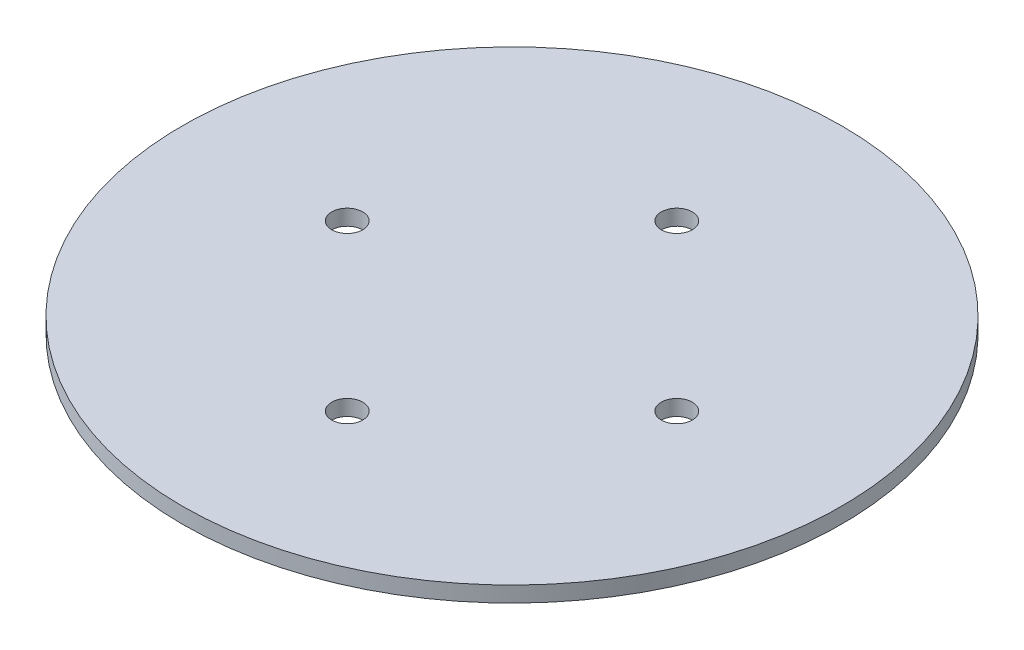
ISO-10303-21;
HEADER;
FILE_DESCRIPTION(('STEP AP214'),'2;1');
FILE_NAME('part.step','',(''),(''),'','','');
FILE_SCHEMA(('AUTOMOTIVE_DESIGN { 1 0 10303 214 1 1 1 1 }'));
ENDSEC;
DATA;
#1=APPLICATION_CONTEXT('core data for automotive mechanical design processes');
#2=APPLICATION_PROTOCOL_DEFINITION('international standard','automotive_design',2000,#1);
#3=PRODUCT_CONTEXT('',#1,'mechanical');
#4=PRODUCT('Part','Part','',(#3));
#5=PRODUCT_RELATED_PRODUCT_CATEGORY('part','',(#4));
#6=PRODUCT_DEFINITION_FORMATION('','',#4);
#7=PRODUCT_DEFINITION_CONTEXT('part definition',#1,'design');
#8=PRODUCT_DEFINITION('design','',#6,#7);
#9=PRODUCT_DEFINITION_SHAPE('','',#8);
#10=(LENGTH_UNIT() NAMED_UNIT(*) SI_UNIT(.MILLI.,.METRE.));
#11=(NAMED_UNIT(*) PLANE_ANGLE_UNIT() SI_UNIT($,.RADIAN.));
#12=(NAMED_UNIT(*) SI_UNIT($,.STERADIAN.) SOLID_ANGLE_UNIT());
#13=UNCERTAINTY_MEASURE_WITH_UNIT(LENGTH_MEASURE(1.E-05),#10,'distance_accuracy_value','');
#14=(GEOMETRIC_REPRESENTATION_CONTEXT(3) GLOBAL_UNCERTAINTY_ASSIGNED_CONTEXT((#13)) GLOBAL_UNIT_ASSIGNED_CONTEXT((#10,
#11,#12)) REPRESENTATION_CONTEXT('',''));
#15=CARTESIAN_POINT('',(0.,0.,0.));
#16=DIRECTION('',(0.,0.,1.));
#17=DIRECTION('',(1.,0.,0.));
#18=AXIS2_PLACEMENT_3D('',#15,#16,#17);
#19=CARTESIAN_POINT('',(0.,-1.21,0.));
#20=DIRECTION('',(0.,1.,0.));
#21=DIRECTION('',(0.,0.,1.));
#22=AXIS2_PLACEMENT_3D('',#19,#20,#21);
#23=CYLINDRICAL_SURFACE('',#22,25.5);
#24=CARTESIAN_POINT('',(0.,-1.21,0.));
#25=DIRECTION('',(0.,1.,0.));
#26=DIRECTION('',(0.,0.,1.));
#27=AXIS2_PLACEMENT_3D('',#24,#25,#26);
#28=CIRCLE('',#27,25.5);
#29=CARTESIAN_POINT('',(0.,-1.21,25.5));
#30=VERTEX_POINT('',#29);
#31=EDGE_CURVE('E10',#30,#30,#28,.T.);
#32=ORIENTED_EDGE('',*,*,#31,.T.);
#33=EDGE_LOOP('',(#32));
#34=FACE_BOUND('',#33,.T.);
#35=CARTESIAN_POINT('',(0.,0.,0.));
#36=DIRECTION('',(0.,1.,0.));
#37=DIRECTION('',(0.,0.,1.));
#38=AXIS2_PLACEMENT_3D('',#35,#36,#37);
#39=CIRCLE('',#38,25.5);
#40=CARTESIAN_POINT('',(0.,0.,25.5));
#41=VERTEX_POINT('',#40);
#42=EDGE_CURVE('E37',#41,#41,#39,.T.);
#43=ORIENTED_EDGE('',*,*,#42,.F.);
#44=EDGE_LOOP('',(#43));
#45=FACE_BOUND('',#44,.T.);
#46=ADVANCED_FACE('F34',(#34,#45),#23,.T.);
#47=CARTESIAN_POINT('',(0.,-1.21,0.));
#48=DIRECTION('',(0.,1.,0.));
#49=DIRECTION('',(0.,0.,1.));
#50=AXIS2_PLACEMENT_3D('',#47,#48,#49);
#51=PLANE('',#50);
#52=CARTESIAN_POINT('',(0.,-1.21,12.75));
#53=DIRECTION('',(0.,-1.,0.));
#54=DIRECTION('',(0.,0.,-1.));
#55=AXIS2_PLACEMENT_3D('',#52,#53,#54);
#56=CIRCLE('',#55,1.2);
#57=CARTESIAN_POINT('',(0.,-1.21,11.55));
#58=VERTEX_POINT('',#57);
#59=EDGE_CURVE('E66',#58,#58,#56,.T.);
#60=ORIENTED_EDGE('',*,*,#59,.F.);
#61=EDGE_LOOP('',(#60));
#62=FACE_BOUND('',#61,.T.);
#63=CARTESIAN_POINT('',(12.75,-1.21,0.));
#64=DIRECTION('',(0.,-1.,0.));
#65=DIRECTION('',(0.,0.,-1.));
#66=AXIS2_PLACEMENT_3D('',#63,#64,#65);
#67=CIRCLE('',#66,1.2);
#68=CARTESIAN_POINT('',(12.75,-1.21,-1.2));
#69=VERTEX_POINT('',#68);
#70=EDGE_CURVE('E60',#69,#69,#67,.T.);
#71=ORIENTED_EDGE('',*,*,#70,.F.);
#72=EDGE_LOOP('',(#71));
#73=FACE_BOUND('',#72,.T.);
#74=CARTESIAN_POINT('',(-12.75,-1.21,0.));
#75=DIRECTION('',(0.,-1.,0.));
#76=DIRECTION('',(0.,0.,-1.));
#77=AXIS2_PLACEMENT_3D('',#74,#75,#76);
#78=CIRCLE('',#77,1.2);
#79=CARTESIAN_POINT('',(-12.75,-1.21,-1.2));
#80=VERTEX_POINT('',#79);
#81=EDGE_CURVE('E54',#80,#80,#78,.T.);
#82=ORIENTED_EDGE('',*,*,#81,.F.);
#83=EDGE_LOOP('',(#82));
#84=FACE_BOUND('',#83,.T.);
#85=CARTESIAN_POINT('',(0.,-1.21,-12.75));
#86=DIRECTION('',(0.,-1.,0.));
#87=DIRECTION('',(0.,0.,-1.));
#88=AXIS2_PLACEMENT_3D('',#85,#86,#87);
#89=CIRCLE('',#88,1.2);
#90=CARTESIAN_POINT('',(0.,-1.21,-13.95));
#91=VERTEX_POINT('',#90);
#92=EDGE_CURVE('E48',#91,#91,#89,.T.);
#93=ORIENTED_EDGE('',*,*,#92,.F.);
#94=EDGE_LOOP('',(#93));
#95=FACE_BOUND('',#94,.T.);
#96=ORIENTED_EDGE('',*,*,#31,.F.);
#97=EDGE_LOOP('',(#96));
#98=FACE_BOUND('',#97,.T.);
#99=ADVANCED_FACE('F72',(#62,#73,#84,#95,#98),#51,.F.);
#100=CARTESIAN_POINT('',(0.,0.,0.));
#101=DIRECTION('',(0.,1.,0.));
#102=DIRECTION('',(0.,0.,1.));
#103=AXIS2_PLACEMENT_3D('',#100,#101,#102);
#104=PLANE('',#103);
#105=CARTESIAN_POINT('',(0.,0.,12.75));
#106=DIRECTION('',(0.,1.,0.));
#107=DIRECTION('',(0.,0.,1.));
#108=AXIS2_PLACEMENT_3D('',#105,#106,#107);
#109=CIRCLE('',#108,1.2);
#110=CARTESIAN_POINT('',(0.,0.,13.95));
#111=VERTEX_POINT('',#110);
#112=EDGE_CURVE('E63',#111,#111,#109,.T.);
#113=ORIENTED_EDGE('',*,*,#112,.F.);
#114=EDGE_LOOP('',(#113));
#115=FACE_BOUND('',#114,.T.);
#116=CARTESIAN_POINT('',(12.75,0.,0.));
#117=DIRECTION('',(0.,1.,0.));
#118=DIRECTION('',(0.,0.,1.));
#119=AXIS2_PLACEMENT_3D('',#116,#117,#118);
#120=CIRCLE('',#119,1.2);
#121=CARTESIAN_POINT('',(12.75,0.,1.2));
#122=VERTEX_POINT('',#121);
#123=EDGE_CURVE('E57',#122,#122,#120,.T.);
#124=ORIENTED_EDGE('',*,*,#123,.F.);
#125=EDGE_LOOP('',(#124));
#126=FACE_BOUND('',#125,.T.);
#127=CARTESIAN_POINT('',(-12.75,0.,0.));
#128=DIRECTION('',(0.,1.,0.));
#129=DIRECTION('',(0.,0.,1.));
#130=AXIS2_PLACEMENT_3D('',#127,#128,#129);
#131=CIRCLE('',#130,1.2);
#132=CARTESIAN_POINT('',(-12.75,0.,1.2));
#133=VERTEX_POINT('',#132);
#134=EDGE_CURVE('E51',#133,#133,#131,.T.);
#135=ORIENTED_EDGE('',*,*,#134,.F.);
#136=EDGE_LOOP('',(#135));
#137=FACE_BOUND('',#136,.T.);
#138=CARTESIAN_POINT('',(0.,0.,-12.75));
#139=DIRECTION('',(0.,1.,0.));
#140=DIRECTION('',(0.,0.,1.));
#141=AXIS2_PLACEMENT_3D('',#138,#139,#140);
#142=CIRCLE('',#141,1.2);
#143=CARTESIAN_POINT('',(0.,0.,-11.55));
#144=VERTEX_POINT('',#143);
#145=EDGE_CURVE('E44',#144,#144,#142,.T.);
#146=ORIENTED_EDGE('',*,*,#145,.F.);
#147=EDGE_LOOP('',(#146));
#148=FACE_BOUND('',#147,.T.);
#149=ORIENTED_EDGE('',*,*,#42,.T.);
#150=EDGE_LOOP('',(#149));
#151=FACE_BOUND('',#150,.T.);
#152=ADVANCED_FACE('F75',(#115,#126,#137,#148,#151),#104,.T.);
#153=CARTESIAN_POINT('',(0.,-1.21,-12.75));
#154=DIRECTION('',(0.,-1.,0.));
#155=DIRECTION('',(0.,0.,-1.));
#156=AXIS2_PLACEMENT_3D('',#153,#154,#155);
#157=CYLINDRICAL_SURFACE('',#156,1.2);
#158=ORIENTED_EDGE('',*,*,#145,.T.);
#159=EDGE_LOOP('',(#158));
#160=FACE_BOUND('',#159,.T.);
#161=ORIENTED_EDGE('',*,*,#92,.T.);
#162=EDGE_LOOP('',(#161));
#163=FACE_BOUND('',#162,.T.);
#164=ADVANCED_FACE('F84',(#160,#163),#157,.F.);
#165=CARTESIAN_POINT('',(-12.75,-1.21,0.));
#166=DIRECTION('',(0.,-1.,0.));
#167=DIRECTION('',(0.,0.,-1.));
#168=AXIS2_PLACEMENT_3D('',#165,#166,#167);
#169=CYLINDRICAL_SURFACE('',#168,1.2);
#170=ORIENTED_EDGE('',*,*,#134,.T.);
#171=EDGE_LOOP('',(#170));
#172=FACE_BOUND('',#171,.T.);
#173=ORIENTED_EDGE('',*,*,#81,.T.);
#174=EDGE_LOOP('',(#173));
#175=FACE_BOUND('',#174,.T.);
#176=ADVANCED_FACE('F86',(#172,#175),#169,.F.);
#177=CARTESIAN_POINT('',(12.75,-1.21,0.));
#178=DIRECTION('',(0.,-1.,0.));
#179=DIRECTION('',(0.,0.,-1.));
#180=AXIS2_PLACEMENT_3D('',#177,#178,#179);
#181=CYLINDRICAL_SURFACE('',#180,1.2);
#182=ORIENTED_EDGE('',*,*,#123,.T.);
#183=EDGE_LOOP('',(#182));
#184=FACE_BOUND('',#183,.T.);
#185=ORIENTED_EDGE('',*,*,#70,.T.);
#186=EDGE_LOOP('',(#185));
#187=FACE_BOUND('',#186,.T.);
#188=ADVANCED_FACE('F93',(#184,#187),#181,.F.);
#189=CARTESIAN_POINT('',(0.,-1.21,12.75));
#190=DIRECTION('',(0.,-1.,0.));
#191=DIRECTION('',(0.,0.,-1.));
#192=AXIS2_PLACEMENT_3D('',#189,#190,#191);
#193=CYLINDRICAL_SURFACE('',#192,1.2);
#194=ORIENTED_EDGE('',*,*,#112,.T.);
#195=EDGE_LOOP('',(#194));
#196=FACE_BOUND('',#195,.T.);
#197=ORIENTED_EDGE('',*,*,#59,.T.);
#198=EDGE_LOOP('',(#197));
#199=FACE_BOUND('',#198,.T.);
#200=ADVANCED_FACE('F70',(#196,#199),#193,.F.);
#201=CLOSED_SHELL('',(#46,#99,#152,#164,#176,#188,#200));
#202=MANIFOLD_SOLID_BREP('B2',#201);
#203=ADVANCED_BREP_SHAPE_REPRESENTATION('',(#18,#202),#14);
#204=SHAPE_DEFINITION_REPRESENTATION(#9,#203);
ENDSEC;
END-ISO-10303-21;
